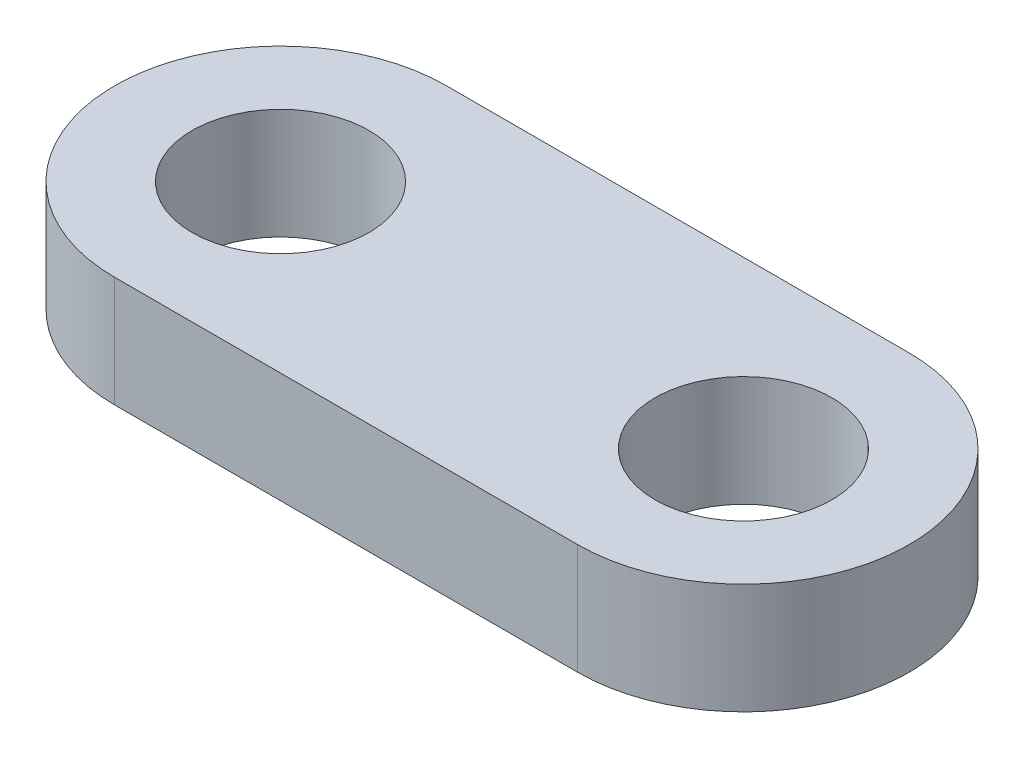
ISO-10303-21;
HEADER;
FILE_DESCRIPTION(('STEP AP214'),'2;1');
FILE_NAME('part.step','',(''),(''),'','','');
FILE_SCHEMA(('AUTOMOTIVE_DESIGN { 1 0 10303 214 1 1 1 1 }'));
ENDSEC;
DATA;
#1=APPLICATION_CONTEXT('core data for automotive mechanical design processes');
#2=APPLICATION_PROTOCOL_DEFINITION('international standard','automotive_design',2000,#1);
#3=PRODUCT_CONTEXT('',#1,'mechanical');
#4=PRODUCT('Part','Part','',(#3));
#5=PRODUCT_RELATED_PRODUCT_CATEGORY('part','',(#4));
#6=PRODUCT_DEFINITION_FORMATION('','',#4);
#7=PRODUCT_DEFINITION_CONTEXT('part definition',#1,'design');
#8=PRODUCT_DEFINITION('design','',#6,#7);
#9=PRODUCT_DEFINITION_SHAPE('','',#8);
#10=(LENGTH_UNIT() NAMED_UNIT(*) SI_UNIT(.MILLI.,.METRE.));
#11=(NAMED_UNIT(*) PLANE_ANGLE_UNIT() SI_UNIT($,.RADIAN.));
#12=(NAMED_UNIT(*) SI_UNIT($,.STERADIAN.) SOLID_ANGLE_UNIT());
#13=UNCERTAINTY_MEASURE_WITH_UNIT(LENGTH_MEASURE(1.E-05),#10,'distance_accuracy_value','');
#14=(GEOMETRIC_REPRESENTATION_CONTEXT(3) GLOBAL_UNCERTAINTY_ASSIGNED_CONTEXT((#13)) GLOBAL_UNIT_ASSIGNED_CONTEXT((#10,
#11,#12)) REPRESENTATION_CONTEXT('',''));
#15=CARTESIAN_POINT('',(0.,0.,0.));
#16=DIRECTION('',(0.,0.,1.));
#17=DIRECTION('',(1.,0.,0.));
#18=AXIS2_PLACEMENT_3D('',#15,#16,#17);
#19=CARTESIAN_POINT('',(0.,5.,0.));
#20=DIRECTION('',(0.,1.,0.));
#21=DIRECTION('',(0.,0.,1.));
#22=AXIS2_PLACEMENT_3D('',#19,#20,#21);
#23=PLANE('',#22);
#24=CARTESIAN_POINT('',(20.93,5.,0.));
#25=DIRECTION('',(0.,1.,0.));
#26=DIRECTION('',(0.,0.,1.));
#27=AXIS2_PLACEMENT_3D('',#24,#25,#26);
#28=CIRCLE('',#27,4.00000000000001);
#29=CARTESIAN_POINT('',(20.93,5.,4.00000000000001));
#30=VERTEX_POINT('',#29);
#31=EDGE_CURVE('E99',#30,#30,#28,.T.);
#32=ORIENTED_EDGE('',*,*,#31,.F.);
#33=EDGE_LOOP('',(#32));
#34=FACE_BOUND('',#33,.T.);
#35=CARTESIAN_POINT('',(0.,5.,0.));
#36=DIRECTION('',(0.,1.,0.));
#37=DIRECTION('',(0.,0.,1.));
#38=AXIS2_PLACEMENT_3D('',#35,#36,#37);
#39=CIRCLE('',#38,7.5);
#40=CARTESIAN_POINT('',(0.,5.,-7.5));
#41=VERTEX_POINT('',#40);
#42=CARTESIAN_POINT('',(0.,5.,7.5));
#43=VERTEX_POINT('',#42);
#44=EDGE_CURVE('E84',#41,#43,#39,.T.);
#45=ORIENTED_EDGE('',*,*,#44,.T.);
#46=DIRECTION('',(1.,0.,0.));
#47=VECTOR('',#46,1.);
#48=CARTESIAN_POINT('',(0.,5.,7.5));
#49=LINE('',#48,#47);
#50=CARTESIAN_POINT('',(20.93,5.,7.5));
#51=VERTEX_POINT('',#50);
#52=EDGE_CURVE('E79',#43,#51,#49,.T.);
#53=ORIENTED_EDGE('',*,*,#52,.T.);
#54=CARTESIAN_POINT('',(20.93,5.,0.));
#55=DIRECTION('',(0.,1.,0.));
#56=DIRECTION('',(0.,0.,1.));
#57=AXIS2_PLACEMENT_3D('',#54,#55,#56);
#58=CIRCLE('',#57,7.5);
#59=CARTESIAN_POINT('',(20.93,5.,-7.5));
#60=VERTEX_POINT('',#59);
#61=EDGE_CURVE('E82',#51,#60,#58,.T.);
#62=ORIENTED_EDGE('',*,*,#61,.T.);
#63=DIRECTION('',(-1.,0.,0.));
#64=VECTOR('',#63,1.);
#65=CARTESIAN_POINT('',(0.,5.,-7.5));
#66=LINE('',#65,#64);
#67=EDGE_CURVE('E49',#60,#41,#66,.T.);
#68=ORIENTED_EDGE('',*,*,#67,.T.);
#69=EDGE_LOOP('',(#45,#53,#62,#68));
#70=FACE_BOUND('',#69,.T.);
#71=CARTESIAN_POINT('',(0.,5.,0.));
#72=DIRECTION('',(0.,1.,0.));
#73=DIRECTION('',(0.,0.,1.));
#74=AXIS2_PLACEMENT_3D('',#71,#72,#73);
#75=CIRCLE('',#74,4.);
#76=CARTESIAN_POINT('',(0.,5.,4.));
#77=VERTEX_POINT('',#76);
#78=EDGE_CURVE('E114',#77,#77,#75,.T.);
#79=ORIENTED_EDGE('',*,*,#78,.F.);
#80=EDGE_LOOP('',(#79));
#81=FACE_BOUND('',#80,.T.);
#82=ADVANCED_FACE('F32',(#34,#70,#81),#23,.T.);
#83=CARTESIAN_POINT('',(0.,0.,0.));
#84=DIRECTION('',(0.,1.,0.));
#85=DIRECTION('',(0.,0.,1.));
#86=AXIS2_PLACEMENT_3D('',#83,#84,#85);
#87=PLANE('',#86);
#88=CARTESIAN_POINT('',(0.,0.,0.));
#89=DIRECTION('',(0.,1.,0.));
#90=DIRECTION('',(0.,0.,1.));
#91=AXIS2_PLACEMENT_3D('',#88,#89,#90);
#92=CIRCLE('',#91,7.5);
#93=CARTESIAN_POINT('',(0.,0.,-7.5));
#94=VERTEX_POINT('',#93);
#95=CARTESIAN_POINT('',(0.,0.,7.5));
#96=VERTEX_POINT('',#95);
#97=EDGE_CURVE('E96',#94,#96,#92,.T.);
#98=ORIENTED_EDGE('',*,*,#97,.F.);
#99=DIRECTION('',(-1.,0.,0.));
#100=VECTOR('',#99,1.);
#101=CARTESIAN_POINT('',(0.,0.,-7.5));
#102=LINE('',#101,#100);
#103=CARTESIAN_POINT('',(20.93,0.,-7.5));
#104=VERTEX_POINT('',#103);
#105=EDGE_CURVE('E72',#104,#94,#102,.T.);
#106=ORIENTED_EDGE('',*,*,#105,.F.);
#107=CARTESIAN_POINT('',(20.93,0.,0.));
#108=DIRECTION('',(0.,1.,0.));
#109=DIRECTION('',(0.,0.,1.));
#110=AXIS2_PLACEMENT_3D('',#107,#108,#109);
#111=CIRCLE('',#110,7.5);
#112=CARTESIAN_POINT('',(20.93,0.,7.5));
#113=VERTEX_POINT('',#112);
#114=EDGE_CURVE('E66',#113,#104,#111,.T.);
#115=ORIENTED_EDGE('',*,*,#114,.F.);
#116=DIRECTION('',(1.,0.,0.));
#117=VECTOR('',#116,1.);
#118=CARTESIAN_POINT('',(0.,0.,7.5));
#119=LINE('',#118,#117);
#120=EDGE_CURVE('E88',#96,#113,#119,.T.);
#121=ORIENTED_EDGE('',*,*,#120,.F.);
#122=EDGE_LOOP('',(#98,#106,#115,#121));
#123=FACE_BOUND('',#122,.T.);
#124=CARTESIAN_POINT('',(20.93,0.,0.));
#125=DIRECTION('',(0.,1.,0.));
#126=DIRECTION('',(0.,0.,1.));
#127=AXIS2_PLACEMENT_3D('',#124,#125,#126);
#128=CIRCLE('',#127,4.00000000000001);
#129=CARTESIAN_POINT('',(20.93,0.,4.00000000000001));
#130=VERTEX_POINT('',#129);
#131=EDGE_CURVE('E111',#130,#130,#128,.T.);
#132=ORIENTED_EDGE('',*,*,#131,.T.);
#133=EDGE_LOOP('',(#132));
#134=FACE_BOUND('',#133,.T.);
#135=CARTESIAN_POINT('',(0.,0.,0.));
#136=DIRECTION('',(0.,1.,0.));
#137=DIRECTION('',(0.,0.,1.));
#138=AXIS2_PLACEMENT_3D('',#135,#136,#137);
#139=CIRCLE('',#138,4.);
#140=CARTESIAN_POINT('',(0.,0.,4.));
#141=VERTEX_POINT('',#140);
#142=EDGE_CURVE('E117',#141,#141,#139,.T.);
#143=ORIENTED_EDGE('',*,*,#142,.T.);
#144=EDGE_LOOP('',(#143));
#145=FACE_BOUND('',#144,.T.);
#146=ADVANCED_FACE('F107',(#123,#134,#145),#87,.F.);
#147=CARTESIAN_POINT('',(0.,5.,0.));
#148=DIRECTION('',(0.,-1.,0.));
#149=DIRECTION('',(0.,0.,-1.));
#150=AXIS2_PLACEMENT_3D('',#147,#148,#149);
#151=CYLINDRICAL_SURFACE('',#150,7.5);
#152=ORIENTED_EDGE('',*,*,#97,.T.);
#153=DIRECTION('',(0.,-1.,0.));
#154=VECTOR('',#153,1.);
#155=CARTESIAN_POINT('',(0.,5.,7.5));
#156=LINE('',#155,#154);
#157=EDGE_CURVE('E11',#43,#96,#156,.T.);
#158=ORIENTED_EDGE('',*,*,#157,.F.);
#159=ORIENTED_EDGE('',*,*,#44,.F.);
#160=DIRECTION('',(0.,-1.,0.));
#161=VECTOR('',#160,1.);
#162=CARTESIAN_POINT('',(0.,5.,-7.5));
#163=LINE('',#162,#161);
#164=EDGE_CURVE('E92',#41,#94,#163,.T.);
#165=ORIENTED_EDGE('',*,*,#164,.T.);
#166=EDGE_LOOP('',(#152,#158,#159,#165));
#167=FACE_BOUND('',#166,.T.);
#168=ADVANCED_FACE('F34',(#167),#151,.T.);
#169=CARTESIAN_POINT('',(0.,5.,7.5));
#170=DIRECTION('',(0.,0.,-1.));
#171=DIRECTION('',(-1.,0.,0.));
#172=AXIS2_PLACEMENT_3D('',#169,#170,#171);
#173=PLANE('',#172);
#174=ORIENTED_EDGE('',*,*,#120,.T.);
#175=DIRECTION('',(0.,-1.,0.));
#176=VECTOR('',#175,1.);
#177=CARTESIAN_POINT('',(20.93,5.,7.5));
#178=LINE('',#177,#176);
#179=EDGE_CURVE('E41',#51,#113,#178,.T.);
#180=ORIENTED_EDGE('',*,*,#179,.F.);
#181=ORIENTED_EDGE('',*,*,#52,.F.);
#182=ORIENTED_EDGE('',*,*,#157,.T.);
#183=EDGE_LOOP('',(#174,#180,#181,#182));
#184=FACE_BOUND('',#183,.T.);
#185=ADVANCED_FACE('F87',(#184),#173,.F.);
#186=CARTESIAN_POINT('',(20.93,5.,0.));
#187=DIRECTION('',(0.,-1.,0.));
#188=DIRECTION('',(0.,0.,-1.));
#189=AXIS2_PLACEMENT_3D('',#186,#187,#188);
#190=CYLINDRICAL_SURFACE('',#189,7.5);
#191=ORIENTED_EDGE('',*,*,#114,.T.);
#192=DIRECTION('',(0.,-1.,0.));
#193=VECTOR('',#192,1.);
#194=CARTESIAN_POINT('',(20.93,5.,-7.5));
#195=LINE('',#194,#193);
#196=EDGE_CURVE('E89',#60,#104,#195,.T.);
#197=ORIENTED_EDGE('',*,*,#196,.F.);
#198=ORIENTED_EDGE('',*,*,#61,.F.);
#199=ORIENTED_EDGE('',*,*,#179,.T.);
#200=EDGE_LOOP('',(#191,#197,#198,#199));
#201=FACE_BOUND('',#200,.T.);
#202=ADVANCED_FACE('F90',(#201),#190,.T.);
#203=CARTESIAN_POINT('',(0.,5.,-7.5));
#204=DIRECTION('',(0.,0.,1.));
#205=DIRECTION('',(1.,0.,0.));
#206=AXIS2_PLACEMENT_3D('',#203,#204,#205);
#207=PLANE('',#206);
#208=ORIENTED_EDGE('',*,*,#105,.T.);
#209=ORIENTED_EDGE('',*,*,#164,.F.);
#210=ORIENTED_EDGE('',*,*,#67,.F.);
#211=ORIENTED_EDGE('',*,*,#196,.T.);
#212=EDGE_LOOP('',(#208,#209,#210,#211));
#213=FACE_BOUND('',#212,.T.);
#214=ADVANCED_FACE('F104',(#213),#207,.F.);
#215=CARTESIAN_POINT('',(20.93,5.,0.));
#216=DIRECTION('',(0.,-1.,0.));
#217=DIRECTION('',(0.,0.,-1.));
#218=AXIS2_PLACEMENT_3D('',#215,#216,#217);
#219=CYLINDRICAL_SURFACE('',#218,4.00000000000001);
#220=ORIENTED_EDGE('',*,*,#31,.T.);
#221=EDGE_LOOP('',(#220));
#222=FACE_BOUND('',#221,.T.);
#223=ORIENTED_EDGE('',*,*,#131,.F.);
#224=EDGE_LOOP('',(#223));
#225=FACE_BOUND('',#224,.T.);
#226=ADVANCED_FACE('F134',(#222,#225),#219,.F.);
#227=CARTESIAN_POINT('',(0.,5.,0.));
#228=DIRECTION('',(0.,-1.,0.));
#229=DIRECTION('',(0.,0.,-1.));
#230=AXIS2_PLACEMENT_3D('',#227,#228,#229);
#231=CYLINDRICAL_SURFACE('',#230,4.);
#232=ORIENTED_EDGE('',*,*,#78,.T.);
#233=EDGE_LOOP('',(#232));
#234=FACE_BOUND('',#233,.T.);
#235=ORIENTED_EDGE('',*,*,#142,.F.);
#236=EDGE_LOOP('',(#235));
#237=FACE_BOUND('',#236,.T.);
#238=ADVANCED_FACE('F123',(#234,#237),#231,.F.);
#239=CLOSED_SHELL('',(#82,#146,#168,#185,#202,#214,#226,#238));
#240=MANIFOLD_SOLID_BREP('B2',#239);
#241=ADVANCED_BREP_SHAPE_REPRESENTATION('',(#18,#240),#14);
#242=SHAPE_DEFINITION_REPRESENTATION(#9,#241);
ENDSEC;
END-ISO-10303-21;
